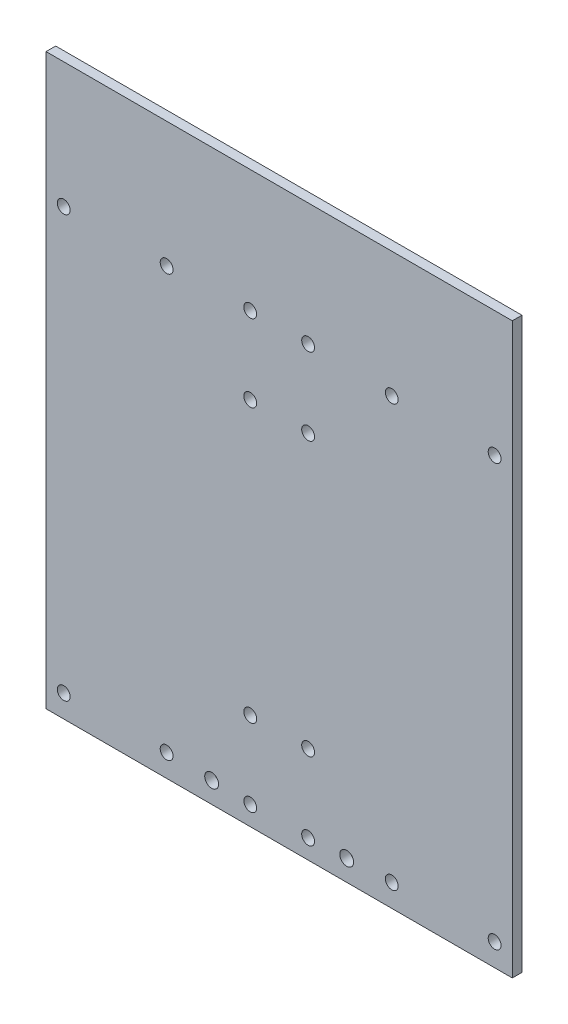
ISO-10303-21;
HEADER;
FILE_DESCRIPTION(('STEP AP214'),'2;1');
FILE_NAME('part.step','',(''),(''),'','','');
FILE_SCHEMA(('AUTOMOTIVE_DESIGN { 1 0 10303 214 1 1 1 1 }'));
ENDSEC;
DATA;
#1=APPLICATION_CONTEXT('core data for automotive mechanical design processes');
#2=APPLICATION_PROTOCOL_DEFINITION('international standard','automotive_design',2000,#1);
#3=PRODUCT_CONTEXT('',#1,'mechanical');
#4=PRODUCT('Part','Part','',(#3));
#5=PRODUCT_RELATED_PRODUCT_CATEGORY('part','',(#4));
#6=PRODUCT_DEFINITION_FORMATION('','',#4);
#7=PRODUCT_DEFINITION_CONTEXT('part definition',#1,'design');
#8=PRODUCT_DEFINITION('design','',#6,#7);
#9=PRODUCT_DEFINITION_SHAPE('','',#8);
#10=(LENGTH_UNIT() NAMED_UNIT(*) SI_UNIT(.MILLI.,.METRE.));
#11=(NAMED_UNIT(*) PLANE_ANGLE_UNIT() SI_UNIT($,.RADIAN.));
#12=(NAMED_UNIT(*) SI_UNIT($,.STERADIAN.) SOLID_ANGLE_UNIT());
#13=UNCERTAINTY_MEASURE_WITH_UNIT(LENGTH_MEASURE(1.E-05),#10,'distance_accuracy_value','');
#14=(GEOMETRIC_REPRESENTATION_CONTEXT(3) GLOBAL_UNCERTAINTY_ASSIGNED_CONTEXT((#13)) GLOBAL_UNIT_ASSIGNED_CONTEXT((#10,
#11,#12)) REPRESENTATION_CONTEXT('',''));
#15=CARTESIAN_POINT('',(0.,0.,0.));
#16=DIRECTION('',(0.,0.,1.));
#17=DIRECTION('',(1.,0.,0.));
#18=AXIS2_PLACEMENT_3D('',#15,#16,#17);
#19=CARTESIAN_POINT('',(0.,104.5,3.));
#20=DIRECTION('',(0.,-1.,0.));
#21=DIRECTION('',(1.,0.,0.));
#22=AXIS2_PLACEMENT_3D('',#19,#20,#21);
#23=PLANE('',#22);
#24=DIRECTION('',(-1.,0.,0.));
#25=VECTOR('',#24,1.);
#26=CARTESIAN_POINT('',(0.,104.5,0.));
#27=LINE('',#26,#25);
#28=CARTESIAN_POINT('',(72.5,104.5,0.));
#29=VERTEX_POINT('',#28);
#30=CARTESIAN_POINT('',(-72.5,104.5,0.));
#31=VERTEX_POINT('',#30);
#32=EDGE_CURVE('E152',#29,#31,#27,.T.);
#33=ORIENTED_EDGE('',*,*,#32,.T.);
#34=DIRECTION('',(0.,0.,-1.));
#35=VECTOR('',#34,1.);
#36=CARTESIAN_POINT('',(-72.5,104.5,3.));
#37=LINE('',#36,#35);
#38=CARTESIAN_POINT('',(-72.5,104.5,3.));
#39=VERTEX_POINT('',#38);
#40=EDGE_CURVE('E11',#39,#31,#37,.T.);
#41=ORIENTED_EDGE('',*,*,#40,.F.);
#42=DIRECTION('',(-1.,0.,0.));
#43=VECTOR('',#42,1.);
#44=CARTESIAN_POINT('',(0.,104.5,3.));
#45=LINE('',#44,#43);
#46=CARTESIAN_POINT('',(72.5,104.5,3.));
#47=VERTEX_POINT('',#46);
#48=EDGE_CURVE('E84',#47,#39,#45,.T.);
#49=ORIENTED_EDGE('',*,*,#48,.F.);
#50=DIRECTION('',(0.,0.,-1.));
#51=VECTOR('',#50,1.);
#52=CARTESIAN_POINT('',(72.5,104.5,3.));
#53=LINE('',#52,#51);
#54=EDGE_CURVE('E50',#47,#29,#53,.T.);
#55=ORIENTED_EDGE('',*,*,#54,.T.);
#56=EDGE_LOOP('',(#33,#41,#49,#55));
#57=FACE_BOUND('',#56,.T.);
#58=ADVANCED_FACE('F33',(#57),#23,.F.);
#59=CARTESIAN_POINT('',(-72.4999999999999,0.,3.));
#60=DIRECTION('',(1.,0.,0.));
#61=DIRECTION('',(0.,1.,0.));
#62=AXIS2_PLACEMENT_3D('',#59,#60,#61);
#63=PLANE('',#62);
#64=DIRECTION('',(0.,-1.,0.));
#65=VECTOR('',#64,1.);
#66=CARTESIAN_POINT('',(-72.4999999999999,0.,0.));
#67=LINE('',#66,#65);
#68=CARTESIAN_POINT('',(-72.4999999999999,-72.5,0.));
#69=VERTEX_POINT('',#68);
#70=EDGE_CURVE('E89',#31,#69,#67,.T.);
#71=ORIENTED_EDGE('',*,*,#70,.T.);
#72=DIRECTION('',(0.,0.,-1.));
#73=VECTOR('',#72,1.);
#74=CARTESIAN_POINT('',(-72.4999999999999,-72.5,3.));
#75=LINE('',#74,#73);
#76=CARTESIAN_POINT('',(-72.4999999999999,-72.5,3.));
#77=VERTEX_POINT('',#76);
#78=EDGE_CURVE('E42',#77,#69,#75,.T.);
#79=ORIENTED_EDGE('',*,*,#78,.F.);
#80=DIRECTION('',(0.,-1.,0.));
#81=VECTOR('',#80,1.);
#82=CARTESIAN_POINT('',(-72.4999999999999,0.,3.));
#83=LINE('',#82,#81);
#84=EDGE_CURVE('E76',#39,#77,#83,.T.);
#85=ORIENTED_EDGE('',*,*,#84,.F.);
#86=ORIENTED_EDGE('',*,*,#40,.T.);
#87=EDGE_LOOP('',(#71,#79,#85,#86));
#88=FACE_BOUND('',#87,.T.);
#89=ADVANCED_FACE('F88',(#88),#63,.F.);
#90=CARTESIAN_POINT('',(0.,-72.5,3.));
#91=DIRECTION('',(0.,1.,0.));
#92=DIRECTION('',(-1.,0.,0.));
#93=AXIS2_PLACEMENT_3D('',#90,#91,#92);
#94=PLANE('',#93);
#95=DIRECTION('',(1.,0.,0.));
#96=VECTOR('',#95,1.);
#97=CARTESIAN_POINT('',(0.,-72.5,0.));
#98=LINE('',#97,#96);
#99=CARTESIAN_POINT('',(72.5,-72.5,0.));
#100=VERTEX_POINT('',#99);
#101=EDGE_CURVE('E155',#69,#100,#98,.T.);
#102=ORIENTED_EDGE('',*,*,#101,.T.);
#103=DIRECTION('',(0.,0.,-1.));
#104=VECTOR('',#103,1.);
#105=CARTESIAN_POINT('',(72.5,-72.5,3.));
#106=LINE('',#105,#104);
#107=CARTESIAN_POINT('',(72.5,-72.5,3.));
#108=VERTEX_POINT('',#107);
#109=EDGE_CURVE('E65',#108,#100,#106,.T.);
#110=ORIENTED_EDGE('',*,*,#109,.F.);
#111=DIRECTION('',(1.,0.,0.));
#112=VECTOR('',#111,1.);
#113=CARTESIAN_POINT('',(0.,-72.5,3.));
#114=LINE('',#113,#112);
#115=EDGE_CURVE('E83',#77,#108,#114,.T.);
#116=ORIENTED_EDGE('',*,*,#115,.F.);
#117=ORIENTED_EDGE('',*,*,#78,.T.);
#118=EDGE_LOOP('',(#102,#110,#116,#117));
#119=FACE_BOUND('',#118,.T.);
#120=ADVANCED_FACE('F92',(#119),#94,.F.);
#121=CARTESIAN_POINT('',(-35.,-65.5,3.));
#122=DIRECTION('',(0.,0.,-1.));
#123=DIRECTION('',(-1.,0.,0.));
#124=AXIS2_PLACEMENT_3D('',#121,#122,#123);
#125=CYLINDRICAL_SURFACE('',#124,2.);
#126=CARTESIAN_POINT('',(-35.,-65.5,3.));
#127=DIRECTION('',(0.,0.,1.));
#128=DIRECTION('',(1.,0.,0.));
#129=AXIS2_PLACEMENT_3D('',#126,#127,#128);
#130=CIRCLE('',#129,2.);
#131=CARTESIAN_POINT('',(-33.,-65.5,3.));
#132=VERTEX_POINT('',#131);
#133=EDGE_CURVE('E104',#132,#132,#130,.F.);
#134=ORIENTED_EDGE('',*,*,#133,.F.);
#135=EDGE_LOOP('',(#134));
#136=FACE_BOUND('',#135,.T.);
#137=CARTESIAN_POINT('',(-35.,-65.5,0.));
#138=DIRECTION('',(0.,0.,1.));
#139=DIRECTION('',(1.,0.,0.));
#140=AXIS2_PLACEMENT_3D('',#137,#138,#139);
#141=CIRCLE('',#140,2.);
#142=CARTESIAN_POINT('',(-33.,-65.5,0.));
#143=VERTEX_POINT('',#142);
#144=EDGE_CURVE('E166',#143,#143,#141,.F.);
#145=ORIENTED_EDGE('',*,*,#144,.T.);
#146=EDGE_LOOP('',(#145));
#147=FACE_BOUND('',#146,.T.);
#148=ADVANCED_FACE('F335',(#136,#147),#125,.F.);
#149=CARTESIAN_POINT('',(9.00000000000001,-42.5,3.));
#150=DIRECTION('',(0.,0.,-1.));
#151=DIRECTION('',(-1.,0.,0.));
#152=AXIS2_PLACEMENT_3D('',#149,#150,#151);
#153=CYLINDRICAL_SURFACE('',#152,2.);
#154=CARTESIAN_POINT('',(9.00000000000001,-42.5,3.));
#155=DIRECTION('',(0.,0.,1.));
#156=DIRECTION('',(1.,0.,0.));
#157=AXIS2_PLACEMENT_3D('',#154,#155,#156);
#158=CIRCLE('',#157,2.);
#159=CARTESIAN_POINT('',(11.,-42.5,3.));
#160=VERTEX_POINT('',#159);
#161=EDGE_CURVE('E101',#160,#160,#158,.F.);
#162=ORIENTED_EDGE('',*,*,#161,.F.);
#163=EDGE_LOOP('',(#162));
#164=FACE_BOUND('',#163,.T.);
#165=CARTESIAN_POINT('',(9.00000000000001,-42.5,0.));
#166=DIRECTION('',(0.,0.,1.));
#167=DIRECTION('',(1.,0.,0.));
#168=AXIS2_PLACEMENT_3D('',#165,#166,#167);
#169=CIRCLE('',#168,2.);
#170=CARTESIAN_POINT('',(11.,-42.5,0.));
#171=VERTEX_POINT('',#170);
#172=EDGE_CURVE('E163',#171,#171,#169,.F.);
#173=ORIENTED_EDGE('',*,*,#172,.T.);
#174=EDGE_LOOP('',(#173));
#175=FACE_BOUND('',#174,.T.);
#176=ADVANCED_FACE('F337',(#164,#175),#153,.F.);
#177=CARTESIAN_POINT('',(-8.99999999999999,-66.5,3.));
#178=DIRECTION('',(0.,0.,-1.));
#179=DIRECTION('',(-1.,0.,0.));
#180=AXIS2_PLACEMENT_3D('',#177,#178,#179);
#181=CYLINDRICAL_SURFACE('',#180,2.);
#182=CARTESIAN_POINT('',(-8.99999999999999,-66.5,3.));
#183=DIRECTION('',(0.,0.,1.));
#184=DIRECTION('',(1.,0.,0.));
#185=AXIS2_PLACEMENT_3D('',#182,#183,#184);
#186=CIRCLE('',#185,2.);
#187=CARTESIAN_POINT('',(-6.99999999999998,-66.5,3.));
#188=VERTEX_POINT('',#187);
#189=EDGE_CURVE('E95',#188,#188,#186,.F.);
#190=ORIENTED_EDGE('',*,*,#189,.F.);
#191=EDGE_LOOP('',(#190));
#192=FACE_BOUND('',#191,.T.);
#193=CARTESIAN_POINT('',(-8.99999999999999,-66.5,0.));
#194=DIRECTION('',(0.,0.,1.));
#195=DIRECTION('',(1.,0.,0.));
#196=AXIS2_PLACEMENT_3D('',#193,#194,#195);
#197=CIRCLE('',#196,2.);
#198=CARTESIAN_POINT('',(-6.99999999999998,-66.5,0.));
#199=VERTEX_POINT('',#198);
#200=EDGE_CURVE('E160',#199,#199,#197,.F.);
#201=ORIENTED_EDGE('',*,*,#200,.T.);
#202=EDGE_LOOP('',(#201));
#203=FACE_BOUND('',#202,.T.);
#204=ADVANCED_FACE('F344',(#192,#203),#181,.F.);
#205=CARTESIAN_POINT('',(72.5,0.,3.));
#206=DIRECTION('',(1.,0.,0.));
#207=DIRECTION('',(0.,1.,0.));
#208=AXIS2_PLACEMENT_3D('',#205,#206,#207);
#209=PLANE('',#208);
#210=DIRECTION('',(0.,-1.,0.));
#211=VECTOR('',#210,1.);
#212=CARTESIAN_POINT('',(72.5,0.,0.));
#213=LINE('',#212,#211);
#214=EDGE_CURVE('E157',#29,#100,#213,.T.);
#215=ORIENTED_EDGE('',*,*,#214,.F.);
#216=ORIENTED_EDGE('',*,*,#54,.F.);
#217=DIRECTION('',(0.,-1.,0.));
#218=VECTOR('',#217,1.);
#219=CARTESIAN_POINT('',(72.5,0.,3.));
#220=LINE('',#219,#218);
#221=EDGE_CURVE('E93',#47,#108,#220,.T.);
#222=ORIENTED_EDGE('',*,*,#221,.T.);
#223=ORIENTED_EDGE('',*,*,#109,.T.);
#224=EDGE_LOOP('',(#215,#216,#222,#223));
#225=FACE_BOUND('',#224,.T.);
#226=ADVANCED_FACE('F248',(#225),#209,.T.);
#227=CARTESIAN_POINT('',(9.,42.5,3.));
#228=DIRECTION('',(0.,0.,-1.));
#229=DIRECTION('',(-1.,0.,0.));
#230=AXIS2_PLACEMENT_3D('',#227,#228,#229);
#231=CYLINDRICAL_SURFACE('',#230,2.);
#232=CARTESIAN_POINT('',(9.,42.5,3.));
#233=DIRECTION('',(0.,0.,1.));
#234=DIRECTION('',(1.,0.,0.));
#235=AXIS2_PLACEMENT_3D('',#232,#233,#234);
#236=CIRCLE('',#235,2.);
#237=CARTESIAN_POINT('',(11.,42.5,3.));
#238=VERTEX_POINT('',#237);
#239=EDGE_CURVE('E217',#238,#238,#236,.T.);
#240=ORIENTED_EDGE('',*,*,#239,.T.);
#241=EDGE_LOOP('',(#240));
#242=FACE_BOUND('',#241,.T.);
#243=CARTESIAN_POINT('',(9.,42.5,0.));
#244=DIRECTION('',(0.,0.,1.));
#245=DIRECTION('',(1.,0.,0.));
#246=AXIS2_PLACEMENT_3D('',#243,#244,#245);
#247=CIRCLE('',#246,2.);
#248=CARTESIAN_POINT('',(11.,42.5,0.));
#249=VERTEX_POINT('',#248);
#250=EDGE_CURVE('E149',#249,#249,#247,.T.);
#251=ORIENTED_EDGE('',*,*,#250,.F.);
#252=EDGE_LOOP('',(#251));
#253=FACE_BOUND('',#252,.T.);
#254=ADVANCED_FACE('F221',(#242,#253),#231,.F.);
#255=CARTESIAN_POINT('',(-9.,42.5,3.));
#256=DIRECTION('',(0.,0.,-1.));
#257=DIRECTION('',(-1.,0.,0.));
#258=AXIS2_PLACEMENT_3D('',#255,#256,#257);
#259=CYLINDRICAL_SURFACE('',#258,2.);
#260=CARTESIAN_POINT('',(-9.,42.5,3.));
#261=DIRECTION('',(0.,0.,1.));
#262=DIRECTION('',(1.,0.,0.));
#263=AXIS2_PLACEMENT_3D('',#260,#261,#262);
#264=CIRCLE('',#263,2.);
#265=CARTESIAN_POINT('',(-6.99999999999999,42.5,3.));
#266=VERTEX_POINT('',#265);
#267=EDGE_CURVE('E214',#266,#266,#264,.T.);
#268=ORIENTED_EDGE('',*,*,#267,.T.);
#269=EDGE_LOOP('',(#268));
#270=FACE_BOUND('',#269,.T.);
#271=CARTESIAN_POINT('',(-9.,42.5,0.));
#272=DIRECTION('',(0.,0.,1.));
#273=DIRECTION('',(1.,0.,0.));
#274=AXIS2_PLACEMENT_3D('',#271,#272,#273);
#275=CIRCLE('',#274,2.);
#276=CARTESIAN_POINT('',(-6.99999999999999,42.5,0.));
#277=VERTEX_POINT('',#276);
#278=EDGE_CURVE('E146',#277,#277,#275,.T.);
#279=ORIENTED_EDGE('',*,*,#278,.F.);
#280=EDGE_LOOP('',(#279));
#281=FACE_BOUND('',#280,.T.);
#282=ADVANCED_FACE('F247',(#270,#281),#259,.F.);
#283=CARTESIAN_POINT('',(-9.,66.5,3.));
#284=DIRECTION('',(0.,0.,-1.));
#285=DIRECTION('',(-1.,0.,0.));
#286=AXIS2_PLACEMENT_3D('',#283,#284,#285);
#287=CYLINDRICAL_SURFACE('',#286,2.);
#288=CARTESIAN_POINT('',(-9.,66.5,3.));
#289=DIRECTION('',(0.,0.,1.));
#290=DIRECTION('',(1.,0.,0.));
#291=AXIS2_PLACEMENT_3D('',#288,#289,#290);
#292=CIRCLE('',#291,2.);
#293=CARTESIAN_POINT('',(-7.,66.5,3.));
#294=VERTEX_POINT('',#293);
#295=EDGE_CURVE('E211',#294,#294,#292,.T.);
#296=ORIENTED_EDGE('',*,*,#295,.T.);
#297=EDGE_LOOP('',(#296));
#298=FACE_BOUND('',#297,.T.);
#299=CARTESIAN_POINT('',(-9.,66.5,0.));
#300=DIRECTION('',(0.,0.,1.));
#301=DIRECTION('',(1.,0.,0.));
#302=AXIS2_PLACEMENT_3D('',#299,#300,#301);
#303=CIRCLE('',#302,2.);
#304=CARTESIAN_POINT('',(-7.,66.5,0.));
#305=VERTEX_POINT('',#304);
#306=EDGE_CURVE('E143',#305,#305,#303,.T.);
#307=ORIENTED_EDGE('',*,*,#306,.F.);
#308=EDGE_LOOP('',(#307));
#309=FACE_BOUND('',#308,.T.);
#310=ADVANCED_FACE('F251',(#298,#309),#287,.F.);
#311=CARTESIAN_POINT('',(9.,66.5,3.));
#312=DIRECTION('',(0.,0.,-1.));
#313=DIRECTION('',(-1.,0.,0.));
#314=AXIS2_PLACEMENT_3D('',#311,#312,#313);
#315=CYLINDRICAL_SURFACE('',#314,2.);
#316=CARTESIAN_POINT('',(9.,66.5,3.));
#317=DIRECTION('',(0.,0.,1.));
#318=DIRECTION('',(1.,0.,0.));
#319=AXIS2_PLACEMENT_3D('',#316,#317,#318);
#320=CIRCLE('',#319,2.);
#321=CARTESIAN_POINT('',(11.,66.5,3.));
#322=VERTEX_POINT('',#321);
#323=EDGE_CURVE('E208',#322,#322,#320,.T.);
#324=ORIENTED_EDGE('',*,*,#323,.T.);
#325=EDGE_LOOP('',(#324));
#326=FACE_BOUND('',#325,.T.);
#327=CARTESIAN_POINT('',(9.,66.5,0.));
#328=DIRECTION('',(0.,0.,1.));
#329=DIRECTION('',(1.,0.,0.));
#330=AXIS2_PLACEMENT_3D('',#327,#328,#329);
#331=CIRCLE('',#330,2.);
#332=CARTESIAN_POINT('',(11.,66.5,0.));
#333=VERTEX_POINT('',#332);
#334=EDGE_CURVE('E140',#333,#333,#331,.T.);
#335=ORIENTED_EDGE('',*,*,#334,.F.);
#336=EDGE_LOOP('',(#335));
#337=FACE_BOUND('',#336,.T.);
#338=ADVANCED_FACE('F255',(#326,#337),#315,.F.);
#339=CARTESIAN_POINT('',(9.00000000000001,-66.5,3.));
#340=DIRECTION('',(0.,0.,-1.));
#341=DIRECTION('',(-1.,0.,0.));
#342=AXIS2_PLACEMENT_3D('',#339,#340,#341);
#343=CYLINDRICAL_SURFACE('',#342,2.);
#344=CARTESIAN_POINT('',(9.00000000000001,-66.5,3.));
#345=DIRECTION('',(0.,0.,1.));
#346=DIRECTION('',(1.,0.,0.));
#347=AXIS2_PLACEMENT_3D('',#344,#345,#346);
#348=CIRCLE('',#347,2.);
#349=CARTESIAN_POINT('',(11.,-66.5,3.));
#350=VERTEX_POINT('',#349);
#351=EDGE_CURVE('E205',#350,#350,#348,.F.);
#352=ORIENTED_EDGE('',*,*,#351,.F.);
#353=EDGE_LOOP('',(#352));
#354=FACE_BOUND('',#353,.T.);
#355=CARTESIAN_POINT('',(9.00000000000001,-66.5,0.));
#356=DIRECTION('',(0.,0.,1.));
#357=DIRECTION('',(1.,0.,0.));
#358=AXIS2_PLACEMENT_3D('',#355,#356,#357);
#359=CIRCLE('',#358,2.);
#360=CARTESIAN_POINT('',(11.,-66.5,0.));
#361=VERTEX_POINT('',#360);
#362=EDGE_CURVE('E137',#361,#361,#359,.F.);
#363=ORIENTED_EDGE('',*,*,#362,.T.);
#364=EDGE_LOOP('',(#363));
#365=FACE_BOUND('',#364,.T.);
#366=ADVANCED_FACE('F259',(#354,#365),#343,.F.);
#367=CARTESIAN_POINT('',(-8.99999999999999,-42.5,3.));
#368=DIRECTION('',(0.,0.,-1.));
#369=DIRECTION('',(-1.,0.,0.));
#370=AXIS2_PLACEMENT_3D('',#367,#368,#369);
#371=CYLINDRICAL_SURFACE('',#370,2.);
#372=CARTESIAN_POINT('',(-8.99999999999999,-42.5,3.));
#373=DIRECTION('',(0.,0.,1.));
#374=DIRECTION('',(1.,0.,0.));
#375=AXIS2_PLACEMENT_3D('',#372,#373,#374);
#376=CIRCLE('',#375,2.);
#377=CARTESIAN_POINT('',(-6.99999999999998,-42.5,3.));
#378=VERTEX_POINT('',#377);
#379=EDGE_CURVE('E202',#378,#378,#376,.F.);
#380=ORIENTED_EDGE('',*,*,#379,.F.);
#381=EDGE_LOOP('',(#380));
#382=FACE_BOUND('',#381,.T.);
#383=CARTESIAN_POINT('',(-8.99999999999999,-42.5,0.));
#384=DIRECTION('',(0.,0.,1.));
#385=DIRECTION('',(1.,0.,0.));
#386=AXIS2_PLACEMENT_3D('',#383,#384,#385);
#387=CIRCLE('',#386,2.);
#388=CARTESIAN_POINT('',(-6.99999999999998,-42.5,0.));
#389=VERTEX_POINT('',#388);
#390=EDGE_CURVE('E134',#389,#389,#387,.F.);
#391=ORIENTED_EDGE('',*,*,#390,.T.);
#392=EDGE_LOOP('',(#391));
#393=FACE_BOUND('',#392,.T.);
#394=ADVANCED_FACE('F263',(#382,#393),#371,.F.);
#395=CARTESIAN_POINT('',(-21.,-66.,3.));
#396=DIRECTION('',(0.,0.,-1.));
#397=DIRECTION('',(-1.,0.,0.));
#398=AXIS2_PLACEMENT_3D('',#395,#396,#397);
#399=CYLINDRICAL_SURFACE('',#398,2.1620902939182);
#400=CARTESIAN_POINT('',(-21.,-66.,3.));
#401=DIRECTION('',(0.,0.,1.));
#402=DIRECTION('',(1.,0.,0.));
#403=AXIS2_PLACEMENT_3D('',#400,#401,#402);
#404=CIRCLE('',#403,2.1620902939182);
#405=CARTESIAN_POINT('',(-18.8379097060818,-66.,3.));
#406=VERTEX_POINT('',#405);
#407=EDGE_CURVE('E199',#406,#406,#404,.T.);
#408=ORIENTED_EDGE('',*,*,#407,.T.);
#409=EDGE_LOOP('',(#408));
#410=FACE_BOUND('',#409,.T.);
#411=CARTESIAN_POINT('',(-21.,-66.,0.));
#412=DIRECTION('',(0.,0.,1.));
#413=DIRECTION('',(1.,0.,0.));
#414=AXIS2_PLACEMENT_3D('',#411,#412,#413);
#415=CIRCLE('',#414,2.1620902939182);
#416=CARTESIAN_POINT('',(-18.8379097060818,-66.,0.));
#417=VERTEX_POINT('',#416);
#418=EDGE_CURVE('E131',#417,#417,#415,.T.);
#419=ORIENTED_EDGE('',*,*,#418,.F.);
#420=EDGE_LOOP('',(#419));
#421=FACE_BOUND('',#420,.T.);
#422=ADVANCED_FACE('F267',(#410,#421),#399,.F.);
#423=CARTESIAN_POINT('',(21.,-66.,3.));
#424=DIRECTION('',(0.,0.,-1.));
#425=DIRECTION('',(-1.,0.,0.));
#426=AXIS2_PLACEMENT_3D('',#423,#424,#425);
#427=CYLINDRICAL_SURFACE('',#426,2.1620902939182);
#428=CARTESIAN_POINT('',(21.,-66.,3.));
#429=DIRECTION('',(0.,0.,1.));
#430=DIRECTION('',(1.,0.,0.));
#431=AXIS2_PLACEMENT_3D('',#428,#429,#430);
#432=CIRCLE('',#431,2.1620902939182);
#433=CARTESIAN_POINT('',(23.1620902939182,-66.,3.));
#434=VERTEX_POINT('',#433);
#435=EDGE_CURVE('E196',#434,#434,#432,.T.);
#436=ORIENTED_EDGE('',*,*,#435,.T.);
#437=EDGE_LOOP('',(#436));
#438=FACE_BOUND('',#437,.T.);
#439=CARTESIAN_POINT('',(21.,-66.,0.));
#440=DIRECTION('',(0.,0.,1.));
#441=DIRECTION('',(1.,0.,0.));
#442=AXIS2_PLACEMENT_3D('',#439,#440,#441);
#443=CIRCLE('',#442,2.1620902939182);
#444=CARTESIAN_POINT('',(23.1620902939182,-66.,0.));
#445=VERTEX_POINT('',#444);
#446=EDGE_CURVE('E128',#445,#445,#443,.T.);
#447=ORIENTED_EDGE('',*,*,#446,.F.);
#448=EDGE_LOOP('',(#447));
#449=FACE_BOUND('',#448,.T.);
#450=ADVANCED_FACE('F271',(#438,#449),#427,.F.);
#451=CARTESIAN_POINT('',(35.,-65.5,3.));
#452=DIRECTION('',(0.,0.,-1.));
#453=DIRECTION('',(-1.,0.,0.));
#454=AXIS2_PLACEMENT_3D('',#451,#452,#453);
#455=CYLINDRICAL_SURFACE('',#454,2.);
#456=CARTESIAN_POINT('',(35.,-65.5,3.));
#457=DIRECTION('',(0.,0.,1.));
#458=DIRECTION('',(1.,0.,0.));
#459=AXIS2_PLACEMENT_3D('',#456,#457,#458);
#460=CIRCLE('',#459,2.);
#461=CARTESIAN_POINT('',(37.,-65.5,3.));
#462=VERTEX_POINT('',#461);
#463=EDGE_CURVE('E193',#462,#462,#460,.T.);
#464=ORIENTED_EDGE('',*,*,#463,.T.);
#465=EDGE_LOOP('',(#464));
#466=FACE_BOUND('',#465,.T.);
#467=CARTESIAN_POINT('',(35.,-65.5,0.));
#468=DIRECTION('',(0.,0.,1.));
#469=DIRECTION('',(1.,0.,0.));
#470=AXIS2_PLACEMENT_3D('',#467,#468,#469);
#471=CIRCLE('',#470,2.);
#472=CARTESIAN_POINT('',(37.,-65.5,0.));
#473=VERTEX_POINT('',#472);
#474=EDGE_CURVE('E125',#473,#473,#471,.T.);
#475=ORIENTED_EDGE('',*,*,#474,.F.);
#476=EDGE_LOOP('',(#475));
#477=FACE_BOUND('',#476,.T.);
#478=ADVANCED_FACE('F275',(#466,#477),#455,.F.);
#479=CARTESIAN_POINT('',(67.,-65.5,3.));
#480=DIRECTION('',(0.,0.,-1.));
#481=DIRECTION('',(-1.,0.,0.));
#482=AXIS2_PLACEMENT_3D('',#479,#480,#481);
#483=CYLINDRICAL_SURFACE('',#482,2.);
#484=CARTESIAN_POINT('',(67.,-65.5,3.));
#485=DIRECTION('',(0.,0.,1.));
#486=DIRECTION('',(1.,0.,0.));
#487=AXIS2_PLACEMENT_3D('',#484,#485,#486);
#488=CIRCLE('',#487,2.);
#489=CARTESIAN_POINT('',(69.,-65.5,3.));
#490=VERTEX_POINT('',#489);
#491=EDGE_CURVE('E190',#490,#490,#488,.T.);
#492=ORIENTED_EDGE('',*,*,#491,.T.);
#493=EDGE_LOOP('',(#492));
#494=FACE_BOUND('',#493,.T.);
#495=CARTESIAN_POINT('',(67.,-65.5,0.));
#496=DIRECTION('',(0.,0.,1.));
#497=DIRECTION('',(1.,0.,0.));
#498=AXIS2_PLACEMENT_3D('',#495,#496,#497);
#499=CIRCLE('',#498,2.);
#500=CARTESIAN_POINT('',(69.,-65.5,0.));
#501=VERTEX_POINT('',#500);
#502=EDGE_CURVE('E122',#501,#501,#499,.T.);
#503=ORIENTED_EDGE('',*,*,#502,.F.);
#504=EDGE_LOOP('',(#503));
#505=FACE_BOUND('',#504,.T.);
#506=ADVANCED_FACE('F279',(#494,#505),#483,.F.);
#507=CARTESIAN_POINT('',(-67.,-65.5,3.));
#508=DIRECTION('',(0.,0.,-1.));
#509=DIRECTION('',(-1.,0.,0.));
#510=AXIS2_PLACEMENT_3D('',#507,#508,#509);
#511=CYLINDRICAL_SURFACE('',#510,2.);
#512=CARTESIAN_POINT('',(-67.,-65.5,3.));
#513=DIRECTION('',(0.,0.,1.));
#514=DIRECTION('',(1.,0.,0.));
#515=AXIS2_PLACEMENT_3D('',#512,#513,#514);
#516=CIRCLE('',#515,2.);
#517=CARTESIAN_POINT('',(-65.,-65.5,3.));
#518=VERTEX_POINT('',#517);
#519=EDGE_CURVE('E187',#518,#518,#516,.F.);
#520=ORIENTED_EDGE('',*,*,#519,.F.);
#521=EDGE_LOOP('',(#520));
#522=FACE_BOUND('',#521,.T.);
#523=CARTESIAN_POINT('',(-67.,-65.5,0.));
#524=DIRECTION('',(0.,0.,1.));
#525=DIRECTION('',(1.,0.,0.));
#526=AXIS2_PLACEMENT_3D('',#523,#524,#525);
#527=CIRCLE('',#526,2.);
#528=CARTESIAN_POINT('',(-65.,-65.5,0.));
#529=VERTEX_POINT('',#528);
#530=EDGE_CURVE('E119',#529,#529,#527,.F.);
#531=ORIENTED_EDGE('',*,*,#530,.T.);
#532=EDGE_LOOP('',(#531));
#533=FACE_BOUND('',#532,.T.);
#534=ADVANCED_FACE('F283',(#522,#533),#511,.F.);
#535=CARTESIAN_POINT('',(-67.,65.5,3.));
#536=DIRECTION('',(0.,0.,-1.));
#537=DIRECTION('',(-1.,0.,0.));
#538=AXIS2_PLACEMENT_3D('',#535,#536,#537);
#539=CYLINDRICAL_SURFACE('',#538,2.);
#540=CARTESIAN_POINT('',(-67.,65.5,3.));
#541=DIRECTION('',(0.,0.,1.));
#542=DIRECTION('',(1.,0.,0.));
#543=AXIS2_PLACEMENT_3D('',#540,#541,#542);
#544=CIRCLE('',#543,2.);
#545=CARTESIAN_POINT('',(-65.,65.5,3.));
#546=VERTEX_POINT('',#545);
#547=EDGE_CURVE('E182',#546,#546,#544,.T.);
#548=ORIENTED_EDGE('',*,*,#547,.T.);
#549=EDGE_LOOP('',(#548));
#550=FACE_BOUND('',#549,.T.);
#551=CARTESIAN_POINT('',(-67.,65.5,0.));
#552=DIRECTION('',(0.,0.,1.));
#553=DIRECTION('',(1.,0.,0.));
#554=AXIS2_PLACEMENT_3D('',#551,#552,#553);
#555=CIRCLE('',#554,2.);
#556=CARTESIAN_POINT('',(-65.,65.5,0.));
#557=VERTEX_POINT('',#556);
#558=EDGE_CURVE('E116',#557,#557,#555,.T.);
#559=ORIENTED_EDGE('',*,*,#558,.F.);
#560=EDGE_LOOP('',(#559));
#561=FACE_BOUND('',#560,.T.);
#562=ADVANCED_FACE('F287',(#550,#561),#539,.F.);
#563=CARTESIAN_POINT('',(-35.,65.5,3.));
#564=DIRECTION('',(0.,0.,-1.));
#565=DIRECTION('',(-1.,0.,0.));
#566=AXIS2_PLACEMENT_3D('',#563,#564,#565);
#567=CYLINDRICAL_SURFACE('',#566,2.);
#568=CARTESIAN_POINT('',(-35.,65.5,3.));
#569=DIRECTION('',(0.,0.,1.));
#570=DIRECTION('',(1.,0.,0.));
#571=AXIS2_PLACEMENT_3D('',#568,#569,#570);
#572=CIRCLE('',#571,2.);
#573=CARTESIAN_POINT('',(-33.,65.5,3.));
#574=VERTEX_POINT('',#573);
#575=EDGE_CURVE('E177',#574,#574,#572,.T.);
#576=ORIENTED_EDGE('',*,*,#575,.T.);
#577=EDGE_LOOP('',(#576));
#578=FACE_BOUND('',#577,.T.);
#579=CARTESIAN_POINT('',(-35.,65.5,0.));
#580=DIRECTION('',(0.,0.,1.));
#581=DIRECTION('',(1.,0.,0.));
#582=AXIS2_PLACEMENT_3D('',#579,#580,#581);
#583=CIRCLE('',#582,2.);
#584=CARTESIAN_POINT('',(-33.,65.5,0.));
#585=VERTEX_POINT('',#584);
#586=EDGE_CURVE('E113',#585,#585,#583,.T.);
#587=ORIENTED_EDGE('',*,*,#586,.F.);
#588=EDGE_LOOP('',(#587));
#589=FACE_BOUND('',#588,.T.);
#590=ADVANCED_FACE('F290',(#578,#589),#567,.F.);
#591=CARTESIAN_POINT('',(67.,65.5,3.));
#592=DIRECTION('',(0.,0.,-1.));
#593=DIRECTION('',(-1.,0.,0.));
#594=AXIS2_PLACEMENT_3D('',#591,#592,#593);
#595=CYLINDRICAL_SURFACE('',#594,2.);
#596=CARTESIAN_POINT('',(67.,65.5,3.));
#597=DIRECTION('',(0.,0.,1.));
#598=DIRECTION('',(1.,0.,0.));
#599=AXIS2_PLACEMENT_3D('',#596,#597,#598);
#600=CIRCLE('',#599,2.);
#601=CARTESIAN_POINT('',(69.,65.5,3.));
#602=VERTEX_POINT('',#601);
#603=EDGE_CURVE('E172',#602,#602,#600,.F.);
#604=ORIENTED_EDGE('',*,*,#603,.F.);
#605=EDGE_LOOP('',(#604));
#606=FACE_BOUND('',#605,.T.);
#607=CARTESIAN_POINT('',(67.,65.5,0.));
#608=DIRECTION('',(0.,0.,1.));
#609=DIRECTION('',(1.,0.,0.));
#610=AXIS2_PLACEMENT_3D('',#607,#608,#609);
#611=CIRCLE('',#610,2.);
#612=CARTESIAN_POINT('',(69.,65.5,0.));
#613=VERTEX_POINT('',#612);
#614=EDGE_CURVE('E110',#613,#613,#611,.F.);
#615=ORIENTED_EDGE('',*,*,#614,.T.);
#616=EDGE_LOOP('',(#615));
#617=FACE_BOUND('',#616,.T.);
#618=ADVANCED_FACE('F35',(#606,#617),#595,.F.);
#619=CARTESIAN_POINT('',(35.,65.5,3.));
#620=DIRECTION('',(0.,0.,-1.));
#621=DIRECTION('',(-1.,0.,0.));
#622=AXIS2_PLACEMENT_3D('',#619,#620,#621);
#623=CYLINDRICAL_SURFACE('',#622,2.);
#624=CARTESIAN_POINT('',(35.,65.5,3.));
#625=DIRECTION('',(0.,0.,1.));
#626=DIRECTION('',(1.,0.,0.));
#627=AXIS2_PLACEMENT_3D('',#624,#625,#626);
#628=CIRCLE('',#627,2.);
#629=CARTESIAN_POINT('',(37.,65.5,3.));
#630=VERTEX_POINT('',#629);
#631=EDGE_CURVE('E107',#630,#630,#628,.F.);
#632=ORIENTED_EDGE('',*,*,#631,.F.);
#633=EDGE_LOOP('',(#632));
#634=FACE_BOUND('',#633,.T.);
#635=CARTESIAN_POINT('',(35.,65.5,0.));
#636=DIRECTION('',(0.,0.,1.));
#637=DIRECTION('',(1.,0.,0.));
#638=AXIS2_PLACEMENT_3D('',#635,#636,#637);
#639=CIRCLE('',#638,2.);
#640=CARTESIAN_POINT('',(37.,65.5,0.));
#641=VERTEX_POINT('',#640);
#642=EDGE_CURVE('E169',#641,#641,#639,.F.);
#643=ORIENTED_EDGE('',*,*,#642,.T.);
#644=EDGE_LOOP('',(#643));
#645=FACE_BOUND('',#644,.T.);
#646=ADVANCED_FACE('F226',(#634,#645),#623,.F.);
#647=CARTESIAN_POINT('',(0.,0.,3.));
#648=DIRECTION('',(0.,0.,1.));
#649=DIRECTION('',(1.,0.,0.));
#650=AXIS2_PLACEMENT_3D('',#647,#648,#649);
#651=PLANE('',#650);
#652=ORIENTED_EDGE('',*,*,#603,.T.);
#653=EDGE_LOOP('',(#652));
#654=FACE_BOUND('',#653,.T.);
#655=ORIENTED_EDGE('',*,*,#575,.F.);
#656=EDGE_LOOP('',(#655));
#657=FACE_BOUND('',#656,.T.);
#658=ORIENTED_EDGE('',*,*,#547,.F.);
#659=EDGE_LOOP('',(#658));
#660=FACE_BOUND('',#659,.T.);
#661=ORIENTED_EDGE('',*,*,#519,.T.);
#662=EDGE_LOOP('',(#661));
#663=FACE_BOUND('',#662,.T.);
#664=ORIENTED_EDGE('',*,*,#491,.F.);
#665=EDGE_LOOP('',(#664));
#666=FACE_BOUND('',#665,.T.);
#667=ORIENTED_EDGE('',*,*,#463,.F.);
#668=EDGE_LOOP('',(#667));
#669=FACE_BOUND('',#668,.T.);
#670=ORIENTED_EDGE('',*,*,#435,.F.);
#671=EDGE_LOOP('',(#670));
#672=FACE_BOUND('',#671,.T.);
#673=ORIENTED_EDGE('',*,*,#407,.F.);
#674=EDGE_LOOP('',(#673));
#675=FACE_BOUND('',#674,.T.);
#676=ORIENTED_EDGE('',*,*,#379,.T.);
#677=EDGE_LOOP('',(#676));
#678=FACE_BOUND('',#677,.T.);
#679=ORIENTED_EDGE('',*,*,#351,.T.);
#680=EDGE_LOOP('',(#679));
#681=FACE_BOUND('',#680,.T.);
#682=ORIENTED_EDGE('',*,*,#323,.F.);
#683=EDGE_LOOP('',(#682));
#684=FACE_BOUND('',#683,.T.);
#685=ORIENTED_EDGE('',*,*,#295,.F.);
#686=EDGE_LOOP('',(#685));
#687=FACE_BOUND('',#686,.T.);
#688=ORIENTED_EDGE('',*,*,#267,.F.);
#689=EDGE_LOOP('',(#688));
#690=FACE_BOUND('',#689,.T.);
#691=ORIENTED_EDGE('',*,*,#239,.F.);
#692=EDGE_LOOP('',(#691));
#693=FACE_BOUND('',#692,.T.);
#694=ORIENTED_EDGE('',*,*,#48,.T.);
#695=ORIENTED_EDGE('',*,*,#84,.T.);
#696=ORIENTED_EDGE('',*,*,#115,.T.);
#697=ORIENTED_EDGE('',*,*,#221,.F.);
#698=EDGE_LOOP('',(#694,#695,#696,#697));
#699=FACE_BOUND('',#698,.T.);
#700=ORIENTED_EDGE('',*,*,#189,.T.);
#701=EDGE_LOOP('',(#700));
#702=FACE_BOUND('',#701,.T.);
#703=ORIENTED_EDGE('',*,*,#161,.T.);
#704=EDGE_LOOP('',(#703));
#705=FACE_BOUND('',#704,.T.);
#706=ORIENTED_EDGE('',*,*,#133,.T.);
#707=EDGE_LOOP('',(#706));
#708=FACE_BOUND('',#707,.T.);
#709=ORIENTED_EDGE('',*,*,#631,.T.);
#710=EDGE_LOOP('',(#709));
#711=FACE_BOUND('',#710,.T.);
#712=ADVANCED_FACE('F79',(#654,#657,#660,#663,#666,#669,#672,#675,#678,#681,#684,#687,#690,#693,
#699,#702,#705,#708,#711),#651,.T.);
#713=CARTESIAN_POINT('',(0.,0.,0.));
#714=DIRECTION('',(0.,0.,1.));
#715=DIRECTION('',(1.,0.,0.));
#716=AXIS2_PLACEMENT_3D('',#713,#714,#715);
#717=PLANE('',#716);
#718=ORIENTED_EDGE('',*,*,#614,.F.);
#719=EDGE_LOOP('',(#718));
#720=FACE_BOUND('',#719,.T.);
#721=ORIENTED_EDGE('',*,*,#586,.T.);
#722=EDGE_LOOP('',(#721));
#723=FACE_BOUND('',#722,.T.);
#724=ORIENTED_EDGE('',*,*,#558,.T.);
#725=EDGE_LOOP('',(#724));
#726=FACE_BOUND('',#725,.T.);
#727=ORIENTED_EDGE('',*,*,#530,.F.);
#728=EDGE_LOOP('',(#727));
#729=FACE_BOUND('',#728,.T.);
#730=ORIENTED_EDGE('',*,*,#502,.T.);
#731=EDGE_LOOP('',(#730));
#732=FACE_BOUND('',#731,.T.);
#733=ORIENTED_EDGE('',*,*,#474,.T.);
#734=EDGE_LOOP('',(#733));
#735=FACE_BOUND('',#734,.T.);
#736=ORIENTED_EDGE('',*,*,#446,.T.);
#737=EDGE_LOOP('',(#736));
#738=FACE_BOUND('',#737,.T.);
#739=ORIENTED_EDGE('',*,*,#418,.T.);
#740=EDGE_LOOP('',(#739));
#741=FACE_BOUND('',#740,.T.);
#742=ORIENTED_EDGE('',*,*,#390,.F.);
#743=EDGE_LOOP('',(#742));
#744=FACE_BOUND('',#743,.T.);
#745=ORIENTED_EDGE('',*,*,#362,.F.);
#746=EDGE_LOOP('',(#745));
#747=FACE_BOUND('',#746,.T.);
#748=ORIENTED_EDGE('',*,*,#334,.T.);
#749=EDGE_LOOP('',(#748));
#750=FACE_BOUND('',#749,.T.);
#751=ORIENTED_EDGE('',*,*,#306,.T.);
#752=EDGE_LOOP('',(#751));
#753=FACE_BOUND('',#752,.T.);
#754=ORIENTED_EDGE('',*,*,#278,.T.);
#755=EDGE_LOOP('',(#754));
#756=FACE_BOUND('',#755,.T.);
#757=ORIENTED_EDGE('',*,*,#250,.T.);
#758=EDGE_LOOP('',(#757));
#759=FACE_BOUND('',#758,.T.);
#760=ORIENTED_EDGE('',*,*,#32,.F.);
#761=ORIENTED_EDGE('',*,*,#214,.T.);
#762=ORIENTED_EDGE('',*,*,#101,.F.);
#763=ORIENTED_EDGE('',*,*,#70,.F.);
#764=EDGE_LOOP('',(#760,#761,#762,#763));
#765=FACE_BOUND('',#764,.T.);
#766=ORIENTED_EDGE('',*,*,#200,.F.);
#767=EDGE_LOOP('',(#766));
#768=FACE_BOUND('',#767,.T.);
#769=ORIENTED_EDGE('',*,*,#172,.F.);
#770=EDGE_LOOP('',(#769));
#771=FACE_BOUND('',#770,.T.);
#772=ORIENTED_EDGE('',*,*,#144,.F.);
#773=EDGE_LOOP('',(#772));
#774=FACE_BOUND('',#773,.T.);
#775=ORIENTED_EDGE('',*,*,#642,.F.);
#776=EDGE_LOOP('',(#775));
#777=FACE_BOUND('',#776,.T.);
#778=ADVANCED_FACE('F225',(#720,#723,#726,#729,#732,#735,#738,#741,#744,#747,#750,#753,#756,
#759,#765,#768,#771,#774,#777),#717,.F.);
#779=CLOSED_SHELL('',(#58,#89,#120,#148,#176,#204,#226,#254,#282,#310,#338,#366,#394,#422,#450,
#478,#506,#534,#562,#590,#618,#646,#712,#778));
#780=MANIFOLD_SOLID_BREP('B2',#779);
#781=ADVANCED_BREP_SHAPE_REPRESENTATION('',(#18,#780),#14);
#782=SHAPE_DEFINITION_REPRESENTATION(#9,#781);
ENDSEC;
END-ISO-10303-21;
